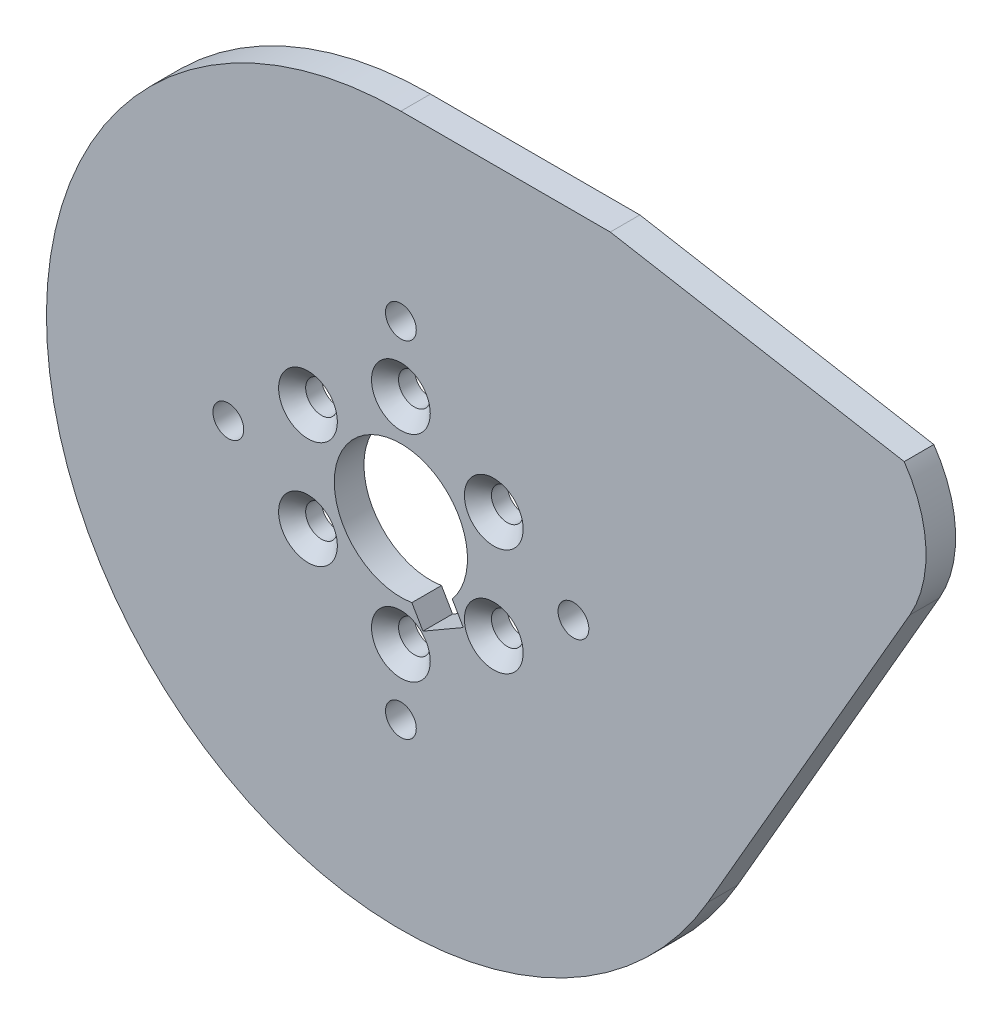
ISO-10303-21;
HEADER;
FILE_DESCRIPTION(('STEP AP214'),'2;1');
FILE_NAME('part.step','',(''),(''),'','','');
FILE_SCHEMA(('AUTOMOTIVE_DESIGN { 1 0 10303 214 1 1 1 1 }'));
ENDSEC;
DATA;
#1=APPLICATION_CONTEXT('core data for automotive mechanical design processes');
#2=APPLICATION_PROTOCOL_DEFINITION('international standard','automotive_design',2000,#1);
#3=PRODUCT_CONTEXT('',#1,'mechanical');
#4=PRODUCT('Part','Part','',(#3));
#5=PRODUCT_RELATED_PRODUCT_CATEGORY('part','',(#4));
#6=PRODUCT_DEFINITION_FORMATION('','',#4);
#7=PRODUCT_DEFINITION_CONTEXT('part definition',#1,'design');
#8=PRODUCT_DEFINITION('design','',#6,#7);
#9=PRODUCT_DEFINITION_SHAPE('','',#8);
#10=(LENGTH_UNIT() NAMED_UNIT(*) SI_UNIT(.MILLI.,.METRE.));
#11=(NAMED_UNIT(*) PLANE_ANGLE_UNIT() SI_UNIT($,.RADIAN.));
#12=(NAMED_UNIT(*) SI_UNIT($,.STERADIAN.) SOLID_ANGLE_UNIT());
#13=UNCERTAINTY_MEASURE_WITH_UNIT(LENGTH_MEASURE(1.E-05),#10,'distance_accuracy_value','');
#14=(GEOMETRIC_REPRESENTATION_CONTEXT(3) GLOBAL_UNCERTAINTY_ASSIGNED_CONTEXT((#13)) GLOBAL_UNIT_ASSIGNED_CONTEXT((#10,
#11,#12)) REPRESENTATION_CONTEXT('',''));
#15=CARTESIAN_POINT('',(0.,0.,0.));
#16=DIRECTION('',(0.,0.,1.));
#17=DIRECTION('',(1.,0.,0.));
#18=AXIS2_PLACEMENT_3D('',#15,#16,#17);
#19=CARTESIAN_POINT('',(43.3012701892193,24.9999999999999,0.));
#20=DIRECTION('',(0.,0.,1.));
#21=DIRECTION('',(1.,0.,0.));
#22=AXIS2_PLACEMENT_3D('',#19,#20,#21);
#23=CYLINDRICAL_SURFACE('',#22,13.0000000000015);
#24=CARTESIAN_POINT('',(43.3012701892193,24.9999999999999,3.175));
#25=DIRECTION('',(0.,0.,1.));
#26=DIRECTION('',(1.,0.,0.));
#27=AXIS2_PLACEMENT_3D('',#24,#25,#26);
#28=CIRCLE('',#27,13.0000000000015);
#29=CARTESIAN_POINT('',(54.5596004384185,18.4999999999991,3.175));
#30=VERTEX_POINT('',#29);
#31=CARTESIAN_POINT('',(53.9595020154315,32.4432583146595,3.175));
#32=VERTEX_POINT('',#31);
#33=EDGE_CURVE('E125',#30,#32,#28,.T.);
#34=ORIENTED_EDGE('',*,*,#33,.F.);
#35=DIRECTION('',(0.,0.,1.));
#36=VECTOR('',#35,1.);
#37=CARTESIAN_POINT('',(54.5596004384185,18.4999999999991,0.));
#38=LINE('',#37,#36);
#39=CARTESIAN_POINT('',(54.5596004384185,18.4999999999991,0.));
#40=VERTEX_POINT('',#39);
#41=EDGE_CURVE('E57',#40,#30,#38,.T.);
#42=ORIENTED_EDGE('',*,*,#41,.F.);
#43=CARTESIAN_POINT('',(43.3012701892193,24.9999999999999,0.));
#44=DIRECTION('',(0.,0.,1.));
#45=DIRECTION('',(1.,0.,0.));
#46=AXIS2_PLACEMENT_3D('',#43,#44,#45);
#47=CIRCLE('',#46,13.0000000000015);
#48=CARTESIAN_POINT('',(53.9595020154315,32.4432583146595,0.));
#49=VERTEX_POINT('',#48);
#50=EDGE_CURVE('E120',#40,#49,#47,.T.);
#51=ORIENTED_EDGE('',*,*,#50,.T.);
#52=DIRECTION('',(0.,0.,1.));
#53=VECTOR('',#52,1.);
#54=CARTESIAN_POINT('',(53.9595020154315,32.4432583146595,0.));
#55=LINE('',#54,#53);
#56=EDGE_CURVE('E87',#49,#32,#55,.T.);
#57=ORIENTED_EDGE('',*,*,#56,.T.);
#58=EDGE_LOOP('',(#34,#42,#51,#57));
#59=FACE_BOUND('',#58,.T.);
#60=ADVANCED_FACE('F34',(#59),#23,.T.);
#61=CARTESIAN_POINT('',(32.9089653438088,-18.9999999999998,0.));
#62=DIRECTION('',(0.866025403784445,-0.499999999999989,0.));
#63=DIRECTION('',(0.499999999999989,0.866025403784445,0.));
#64=AXIS2_PLACEMENT_3D('',#61,#62,#63);
#65=PLANE('',#64);
#66=DIRECTION('',(0.499999999999989,0.866025403784445,0.));
#67=VECTOR('',#66,1.);
#68=CARTESIAN_POINT('',(32.9089653438088,-18.9999999999998,3.175));
#69=LINE('',#68,#67);
#70=CARTESIAN_POINT('',(32.9089653438088,-18.9999999999998,3.175));
#71=VERTEX_POINT('',#70);
#72=EDGE_CURVE('E135',#71,#30,#69,.T.);
#73=ORIENTED_EDGE('',*,*,#72,.F.);
#74=DIRECTION('',(0.,0.,1.));
#75=VECTOR('',#74,1.);
#76=CARTESIAN_POINT('',(32.9089653438088,-18.9999999999998,0.));
#77=LINE('',#76,#75);
#78=CARTESIAN_POINT('',(32.9089653438088,-18.9999999999998,0.));
#79=VERTEX_POINT('',#78);
#80=EDGE_CURVE('E108',#79,#71,#77,.T.);
#81=ORIENTED_EDGE('',*,*,#80,.F.);
#82=DIRECTION('',(0.499999999999989,0.866025403784445,0.));
#83=VECTOR('',#82,1.);
#84=CARTESIAN_POINT('',(32.9089653438088,-18.9999999999998,0.));
#85=LINE('',#84,#83);
#86=EDGE_CURVE('E115',#79,#40,#85,.T.);
#87=ORIENTED_EDGE('',*,*,#86,.T.);
#88=ORIENTED_EDGE('',*,*,#41,.T.);
#89=EDGE_LOOP('',(#73,#81,#87,#88));
#90=FACE_BOUND('',#89,.T.);
#91=ADVANCED_FACE('F163',(#90),#65,.T.);
#92=CARTESIAN_POINT('',(0.,1.23512311489549E-12,0.));
#93=DIRECTION('',(0.,0.,1.));
#94=DIRECTION('',(1.,0.,0.));
#95=AXIS2_PLACEMENT_3D('',#92,#93,#94);
#96=CYLINDRICAL_SURFACE('',#95,38.0000000000004);
#97=CARTESIAN_POINT('',(0.,1.23512311489549E-12,3.175));
#98=DIRECTION('',(0.,0.,1.));
#99=DIRECTION('',(1.,0.,0.));
#100=AXIS2_PLACEMENT_3D('',#97,#98,#99);
#101=CIRCLE('',#100,38.0000000000004);
#102=CARTESIAN_POINT('',(0.,38.0000000000016,3.175));
#103=VERTEX_POINT('',#102);
#104=EDGE_CURVE('E103',#103,#71,#101,.T.);
#105=ORIENTED_EDGE('',*,*,#104,.F.);
#106=DIRECTION('',(0.,0.,1.));
#107=VECTOR('',#106,1.);
#108=CARTESIAN_POINT('',(0.,38.0000000000016,0.));
#109=LINE('',#108,#107);
#110=CARTESIAN_POINT('',(0.,38.0000000000016,0.));
#111=VERTEX_POINT('',#110);
#112=EDGE_CURVE('E97',#111,#103,#109,.T.);
#113=ORIENTED_EDGE('',*,*,#112,.F.);
#114=CARTESIAN_POINT('',(0.,1.23512311489549E-12,0.));
#115=DIRECTION('',(0.,0.,1.));
#116=DIRECTION('',(1.,0.,0.));
#117=AXIS2_PLACEMENT_3D('',#114,#115,#116);
#118=CIRCLE('',#117,38.0000000000004);
#119=EDGE_CURVE('E100',#111,#79,#118,.T.);
#120=ORIENTED_EDGE('',*,*,#119,.T.);
#121=ORIENTED_EDGE('',*,*,#80,.T.);
#122=EDGE_LOOP('',(#105,#113,#120,#121));
#123=FACE_BOUND('',#122,.T.);
#124=ADVANCED_FACE('F99',(#123),#96,.T.);
#125=CARTESIAN_POINT('',(22.4456539190408,38.0000000000013,0.));
#126=DIRECTION('',(0.,1.,0.));
#127=DIRECTION('',(-1.,0.,0.));
#128=AXIS2_PLACEMENT_3D('',#125,#126,#127);
#129=PLANE('',#128);
#130=DIRECTION('',(-1.,0.,0.));
#131=VECTOR('',#130,1.);
#132=CARTESIAN_POINT('',(22.4456539190408,38.0000000000013,3.175));
#133=LINE('',#132,#131);
#134=CARTESIAN_POINT('',(22.4456539190408,38.0000000000013,3.175));
#135=VERTEX_POINT('',#134);
#136=EDGE_CURVE('E132',#135,#103,#133,.T.);
#137=ORIENTED_EDGE('',*,*,#136,.F.);
#138=DIRECTION('',(0.,0.,1.));
#139=VECTOR('',#138,1.);
#140=CARTESIAN_POINT('',(22.4456539190408,38.0000000000013,0.));
#141=LINE('',#140,#139);
#142=CARTESIAN_POINT('',(22.4456539190408,38.0000000000013,0.));
#143=VERTEX_POINT('',#142);
#144=EDGE_CURVE('E109',#143,#135,#141,.T.);
#145=ORIENTED_EDGE('',*,*,#144,.F.);
#146=DIRECTION('',(-1.,0.,0.));
#147=VECTOR('',#146,1.);
#148=CARTESIAN_POINT('',(22.4456539190408,38.0000000000013,0.));
#149=LINE('',#148,#147);
#150=EDGE_CURVE('E114',#143,#111,#149,.T.);
#151=ORIENTED_EDGE('',*,*,#150,.T.);
#152=ORIENTED_EDGE('',*,*,#112,.T.);
#153=EDGE_LOOP('',(#137,#145,#151,#152));
#154=FACE_BOUND('',#153,.T.);
#155=ADVANCED_FACE('F117',(#154),#129,.T.);
#156=CARTESIAN_POINT('',(53.9595020154315,32.4432583146595,0.));
#157=DIRECTION('',(0.173648177666931,0.984807753012208,0.));
#158=DIRECTION('',(-0.984807753012208,0.173648177666931,0.));
#159=AXIS2_PLACEMENT_3D('',#156,#157,#158);
#160=PLANE('',#159);
#161=DIRECTION('',(-0.984807753012208,0.173648177666931,0.));
#162=VECTOR('',#161,1.);
#163=CARTESIAN_POINT('',(53.9595020154315,32.4432583146595,3.175));
#164=LINE('',#163,#162);
#165=EDGE_CURVE('E128',#32,#135,#164,.T.);
#166=ORIENTED_EDGE('',*,*,#165,.F.);
#167=ORIENTED_EDGE('',*,*,#56,.F.);
#168=DIRECTION('',(-0.984807753012208,0.173648177666931,0.));
#169=VECTOR('',#168,1.);
#170=CARTESIAN_POINT('',(53.9595020154315,32.4432583146595,0.));
#171=LINE('',#170,#169);
#172=EDGE_CURVE('E118',#49,#143,#171,.T.);
#173=ORIENTED_EDGE('',*,*,#172,.T.);
#174=ORIENTED_EDGE('',*,*,#144,.T.);
#175=EDGE_LOOP('',(#166,#167,#173,#174));
#176=FACE_BOUND('',#175,.T.);
#177=ADVANCED_FACE('F165',(#176),#160,.T.);
#178=CARTESIAN_POINT('',(43.3012701892193,24.9999999999999,0.));
#179=DIRECTION('',(0.,0.,1.));
#180=DIRECTION('',(1.,0.,0.));
#181=AXIS2_PLACEMENT_3D('',#178,#179,#180);
#182=PLANE('',#181);
#183=CARTESIAN_POINT('',(-9.95929214352075,5.74999999999949,0.));
#184=DIRECTION('',(0.,0.,1.));
#185=DIRECTION('',(1.,0.,0.));
#186=AXIS2_PLACEMENT_3D('',#183,#184,#185);
#187=CIRCLE('',#186,1.69999999999999);
#188=CARTESIAN_POINT('',(-8.25929214352076,5.74999999999949,0.));
#189=VERTEX_POINT('',#188);
#190=EDGE_CURVE('E299',#189,#189,#187,.T.);
#191=ORIENTED_EDGE('',*,*,#190,.T.);
#192=EDGE_LOOP('',(#191));
#193=FACE_BOUND('',#192,.T.);
#194=CARTESIAN_POINT('',(-9.95929214352015,-5.75000000000052,0.));
#195=DIRECTION('',(0.,0.,1.));
#196=DIRECTION('',(1.,0.,0.));
#197=AXIS2_PLACEMENT_3D('',#194,#195,#196);
#198=CIRCLE('',#197,1.69999999999999);
#199=CARTESIAN_POINT('',(-8.25929214352016,-5.75000000000052,0.));
#200=VERTEX_POINT('',#199);
#201=EDGE_CURVE('E308',#200,#200,#198,.T.);
#202=ORIENTED_EDGE('',*,*,#201,.T.);
#203=EDGE_LOOP('',(#202));
#204=FACE_BOUND('',#203,.T.);
#205=CARTESIAN_POINT('',(1.19132134712707E-12,-11.5,0.));
#206=DIRECTION('',(0.,0.,1.));
#207=DIRECTION('',(1.,0.,0.));
#208=AXIS2_PLACEMENT_3D('',#205,#206,#207);
#209=CIRCLE('',#208,1.69999999999999);
#210=CARTESIAN_POINT('',(1.70000000000118,-11.5,0.));
#211=VERTEX_POINT('',#210);
#212=EDGE_CURVE('E317',#211,#211,#209,.T.);
#213=ORIENTED_EDGE('',*,*,#212,.T.);
#214=EDGE_LOOP('',(#213));
#215=FACE_BOUND('',#214,.T.);
#216=CARTESIAN_POINT('',(9.95929214352194,-5.74999999999948,0.));
#217=DIRECTION('',(0.,0.,1.));
#218=DIRECTION('',(1.,0.,0.));
#219=AXIS2_PLACEMENT_3D('',#216,#217,#218);
#220=CIRCLE('',#219,1.69999999999999);
#221=CARTESIAN_POINT('',(11.6592921435219,-5.74999999999948,0.));
#222=VERTEX_POINT('',#221);
#223=EDGE_CURVE('E326',#222,#222,#220,.T.);
#224=ORIENTED_EDGE('',*,*,#223,.T.);
#225=EDGE_LOOP('',(#224));
#226=FACE_BOUND('',#225,.T.);
#227=CARTESIAN_POINT('',(9.95929214352134,5.75000000000052,0.));
#228=DIRECTION('',(0.,0.,1.));
#229=DIRECTION('',(1.,0.,0.));
#230=AXIS2_PLACEMENT_3D('',#227,#228,#229);
#231=CIRCLE('',#230,1.69999999999999);
#232=CARTESIAN_POINT('',(11.6592921435213,5.75000000000052,0.));
#233=VERTEX_POINT('',#232);
#234=EDGE_CURVE('E335',#233,#233,#231,.T.);
#235=ORIENTED_EDGE('',*,*,#234,.T.);
#236=EDGE_LOOP('',(#235));
#237=FACE_BOUND('',#236,.T.);
#238=CARTESIAN_POINT('',(0.,11.5,0.));
#239=DIRECTION('',(0.,0.,1.));
#240=DIRECTION('',(1.,0.,0.));
#241=AXIS2_PLACEMENT_3D('',#238,#239,#240);
#242=CIRCLE('',#241,1.69999999999999);
#243=CARTESIAN_POINT('',(1.69999999999999,11.5,0.));
#244=VERTEX_POINT('',#243);
#245=EDGE_CURVE('E344',#244,#244,#242,.T.);
#246=ORIENTED_EDGE('',*,*,#245,.T.);
#247=EDGE_LOOP('',(#246));
#248=FACE_BOUND('',#247,.T.);
#249=CARTESIAN_POINT('',(18.5000000000006,5.80012052705115E-13,0.));
#250=DIRECTION('',(0.,0.,1.));
#251=DIRECTION('',(1.,0.,0.));
#252=AXIS2_PLACEMENT_3D('',#249,#250,#251);
#253=CIRCLE('',#252,1.64999999999998);
#254=CARTESIAN_POINT('',(20.1500000000006,5.80012052705115E-13,0.));
#255=VERTEX_POINT('',#254);
#256=EDGE_CURVE('E350',#255,#255,#253,.T.);
#257=ORIENTED_EDGE('',*,*,#256,.T.);
#258=EDGE_LOOP('',(#257));
#259=FACE_BOUND('',#258,.T.);
#260=CARTESIAN_POINT('',(1.16002410541023E-12,-18.5,0.));
#261=DIRECTION('',(0.,0.,1.));
#262=DIRECTION('',(1.,0.,0.));
#263=AXIS2_PLACEMENT_3D('',#260,#261,#262);
#264=CIRCLE('',#263,1.64999999999999);
#265=CARTESIAN_POINT('',(1.65000000000115,-18.5,0.));
#266=VERTEX_POINT('',#265);
#267=EDGE_CURVE('E356',#266,#266,#264,.T.);
#268=ORIENTED_EDGE('',*,*,#267,.T.);
#269=EDGE_LOOP('',(#268));
#270=FACE_BOUND('',#269,.T.);
#271=CARTESIAN_POINT('',(-18.4999999999994,-5.82277649283538E-13,0.));
#272=DIRECTION('',(0.,0.,1.));
#273=DIRECTION('',(1.,0.,0.));
#274=AXIS2_PLACEMENT_3D('',#271,#272,#273);
#275=CIRCLE('',#274,1.64999999999998);
#276=CARTESIAN_POINT('',(-16.8499999999994,-5.82277649283538E-13,0.));
#277=VERTEX_POINT('',#276);
#278=EDGE_CURVE('E362',#277,#277,#275,.T.);
#279=ORIENTED_EDGE('',*,*,#278,.T.);
#280=EDGE_LOOP('',(#279));
#281=FACE_BOUND('',#280,.T.);
#282=CARTESIAN_POINT('',(0.,18.5,0.));
#283=DIRECTION('',(0.,0.,1.));
#284=DIRECTION('',(1.,0.,0.));
#285=AXIS2_PLACEMENT_3D('',#282,#283,#284);
#286=CIRCLE('',#285,1.64999999999999);
#287=CARTESIAN_POINT('',(1.64999999999999,18.5,0.));
#288=VERTEX_POINT('',#287);
#289=EDGE_CURVE('E160',#288,#288,#286,.T.);
#290=ORIENTED_EDGE('',*,*,#289,.T.);
#291=EDGE_LOOP('',(#290));
#292=FACE_BOUND('',#291,.T.);
#293=CARTESIAN_POINT('',(0.,0.,0.));
#294=DIRECTION('',(0.,0.,-1.));
#295=DIRECTION('',(-1.,0.,0.));
#296=AXIS2_PLACEMENT_3D('',#293,#294,#295);
#297=CIRCLE('',#296,7.1374);
#298=CARTESIAN_POINT('',(1.177558169701,-7.03959057878869,0.));
#299=VERTEX_POINT('',#298);
#300=CARTESIAN_POINT('',(5.50768518862296,-4.53959057878828,0.));
#301=VERTEX_POINT('',#300);
#302=EDGE_CURVE('E148',#299,#301,#297,.T.);
#303=ORIENTED_EDGE('',*,*,#302,.F.);
#304=DIRECTION('',(-0.500000000000065,0.866025403784401,0.));
#305=VECTOR('',#304,1.);
#306=CARTESIAN_POINT('',(1.10967724974493,-6.92201737656027,0.));
#307=LINE('',#306,#305);
#308=CARTESIAN_POINT('',(2.36418643826195,-9.09489102963338,0.));
#309=VERTEX_POINT('',#308);
#310=EDGE_CURVE('E282',#309,#299,#307,.T.);
#311=ORIENTED_EDGE('',*,*,#310,.F.);
#312=DIRECTION('',(-0.866025403784401,-0.500000000000065,0.));
#313=VECTOR('',#312,1.);
#314=CARTESIAN_POINT('',(2.36418643826195,-9.09489102963338,0.));
#315=LINE('',#314,#313);
#316=CARTESIAN_POINT('',(6.69431345718396,-6.59489102963305,0.));
#317=VERTEX_POINT('',#316);
#318=EDGE_CURVE('E269',#317,#309,#315,.T.);
#319=ORIENTED_EDGE('',*,*,#318,.F.);
#320=DIRECTION('',(0.500000000000065,-0.866025403784401,0.));
#321=VECTOR('',#320,1.);
#322=CARTESIAN_POINT('',(6.69431345718396,-6.59489102963305,0.));
#323=LINE('',#322,#321);
#324=EDGE_CURVE('E279',#301,#317,#323,.T.);
#325=ORIENTED_EDGE('',*,*,#324,.F.);
#326=EDGE_LOOP('',(#303,#311,#319,#325));
#327=FACE_BOUND('',#326,.T.);
#328=ORIENTED_EDGE('',*,*,#50,.F.);
#329=ORIENTED_EDGE('',*,*,#86,.F.);
#330=ORIENTED_EDGE('',*,*,#119,.F.);
#331=ORIENTED_EDGE('',*,*,#150,.F.);
#332=ORIENTED_EDGE('',*,*,#172,.F.);
#333=EDGE_LOOP('',(#328,#329,#330,#331,#332));
#334=FACE_BOUND('',#333,.T.);
#335=ADVANCED_FACE('F113',(#193,#204,#215,#226,#237,#248,#259,#270,#281,#292,#327,#334),#182,.F.);
#336=CARTESIAN_POINT('',(43.3012701892193,24.9999999999999,3.175));
#337=DIRECTION('',(0.,0.,1.));
#338=DIRECTION('',(1.,0.,0.));
#339=AXIS2_PLACEMENT_3D('',#336,#337,#338);
#340=PLANE('',#339);
#341=DIRECTION('',(-0.500000000000065,0.866025403784401,0.));
#342=VECTOR('',#341,1.);
#343=CARTESIAN_POINT('',(1.10967724974493,-6.92201737656027,3.175));
#344=LINE('',#343,#342);
#345=CARTESIAN_POINT('',(2.36418643826195,-9.09489102963338,3.175));
#346=VERTEX_POINT('',#345);
#347=CARTESIAN_POINT('',(1.177558169701,-7.03959057878869,3.175));
#348=VERTEX_POINT('',#347);
#349=EDGE_CURVE('E158',#346,#348,#344,.T.);
#350=ORIENTED_EDGE('',*,*,#349,.T.);
#351=CARTESIAN_POINT('',(0.,0.,3.175));
#352=DIRECTION('',(0.,0.,-1.));
#353=DIRECTION('',(-1.,0.,0.));
#354=AXIS2_PLACEMENT_3D('',#351,#352,#353);
#355=CIRCLE('',#354,7.1374);
#356=CARTESIAN_POINT('',(5.50768518862296,-4.53959057878828,3.175));
#357=VERTEX_POINT('',#356);
#358=EDGE_CURVE('E129',#348,#357,#355,.T.);
#359=ORIENTED_EDGE('',*,*,#358,.T.);
#360=DIRECTION('',(0.500000000000065,-0.866025403784401,0.));
#361=VECTOR('',#360,1.);
#362=CARTESIAN_POINT('',(6.69431345718396,-6.59489102963305,3.175));
#363=LINE('',#362,#361);
#364=CARTESIAN_POINT('',(6.69431345718396,-6.59489102963305,3.175));
#365=VERTEX_POINT('',#364);
#366=EDGE_CURVE('E48',#357,#365,#363,.T.);
#367=ORIENTED_EDGE('',*,*,#366,.T.);
#368=DIRECTION('',(-0.866025403784401,-0.500000000000065,0.));
#369=VECTOR('',#368,1.);
#370=CARTESIAN_POINT('',(2.36418643826195,-9.09489102963338,3.175));
#371=LINE('',#370,#369);
#372=EDGE_CURVE('E288',#365,#346,#371,.T.);
#373=ORIENTED_EDGE('',*,*,#372,.T.);
#374=EDGE_LOOP('',(#350,#359,#367,#373));
#375=FACE_BOUND('',#374,.T.);
#376=CARTESIAN_POINT('',(-9.95929214352075,5.74999999999949,3.175));
#377=DIRECTION('',(0.,0.,1.));
#378=DIRECTION('',(1.,0.,0.));
#379=AXIS2_PLACEMENT_3D('',#376,#377,#378);
#380=CIRCLE('',#379,3.1499999999771);
#381=CARTESIAN_POINT('',(-6.80929214354364,5.74999999999949,3.175));
#382=VERTEX_POINT('',#381);
#383=EDGE_CURVE('E292',#382,#382,#380,.T.);
#384=ORIENTED_EDGE('',*,*,#383,.F.);
#385=EDGE_LOOP('',(#384));
#386=FACE_BOUND('',#385,.T.);
#387=CARTESIAN_POINT('',(-9.95929214352015,-5.75000000000052,3.175));
#388=DIRECTION('',(0.,0.,1.));
#389=DIRECTION('',(1.,0.,0.));
#390=AXIS2_PLACEMENT_3D('',#387,#388,#389);
#391=CIRCLE('',#390,3.1499999999771);
#392=CARTESIAN_POINT('',(-6.80929214354305,-5.75000000000052,3.175));
#393=VERTEX_POINT('',#392);
#394=EDGE_CURVE('E302',#393,#393,#391,.T.);
#395=ORIENTED_EDGE('',*,*,#394,.F.);
#396=EDGE_LOOP('',(#395));
#397=FACE_BOUND('',#396,.T.);
#398=CARTESIAN_POINT('',(1.19132134712707E-12,-11.5,3.175));
#399=DIRECTION('',(0.,0.,1.));
#400=DIRECTION('',(1.,0.,0.));
#401=AXIS2_PLACEMENT_3D('',#398,#399,#400);
#402=CIRCLE('',#401,3.1499999999771);
#403=CARTESIAN_POINT('',(3.14999999997829,-11.5,3.175));
#404=VERTEX_POINT('',#403);
#405=EDGE_CURVE('E311',#404,#404,#402,.T.);
#406=ORIENTED_EDGE('',*,*,#405,.F.);
#407=EDGE_LOOP('',(#406));
#408=FACE_BOUND('',#407,.T.);
#409=CARTESIAN_POINT('',(9.95929214352194,-5.74999999999948,3.175));
#410=DIRECTION('',(0.,0.,1.));
#411=DIRECTION('',(1.,0.,0.));
#412=AXIS2_PLACEMENT_3D('',#409,#410,#411);
#413=CIRCLE('',#412,3.1499999999771);
#414=CARTESIAN_POINT('',(13.109292143499,-5.74999999999948,3.175));
#415=VERTEX_POINT('',#414);
#416=EDGE_CURVE('E320',#415,#415,#413,.T.);
#417=ORIENTED_EDGE('',*,*,#416,.F.);
#418=EDGE_LOOP('',(#417));
#419=FACE_BOUND('',#418,.T.);
#420=CARTESIAN_POINT('',(9.95929214352134,5.75000000000052,3.175));
#421=DIRECTION('',(0.,0.,1.));
#422=DIRECTION('',(1.,0.,0.));
#423=AXIS2_PLACEMENT_3D('',#420,#421,#422);
#424=CIRCLE('',#423,3.1499999999771);
#425=CARTESIAN_POINT('',(13.1092921434984,5.75000000000052,3.175));
#426=VERTEX_POINT('',#425);
#427=EDGE_CURVE('E329',#426,#426,#424,.T.);
#428=ORIENTED_EDGE('',*,*,#427,.F.);
#429=EDGE_LOOP('',(#428));
#430=FACE_BOUND('',#429,.T.);
#431=CARTESIAN_POINT('',(0.,11.5,3.175));
#432=DIRECTION('',(0.,0.,1.));
#433=DIRECTION('',(1.,0.,0.));
#434=AXIS2_PLACEMENT_3D('',#431,#432,#433);
#435=CIRCLE('',#434,3.1499999999771);
#436=CARTESIAN_POINT('',(3.1499999999771,11.5,3.175));
#437=VERTEX_POINT('',#436);
#438=EDGE_CURVE('E338',#437,#437,#435,.T.);
#439=ORIENTED_EDGE('',*,*,#438,.F.);
#440=EDGE_LOOP('',(#439));
#441=FACE_BOUND('',#440,.T.);
#442=CARTESIAN_POINT('',(18.5000000000006,5.80012052705115E-13,3.175));
#443=DIRECTION('',(0.,0.,1.));
#444=DIRECTION('',(1.,0.,0.));
#445=AXIS2_PLACEMENT_3D('',#442,#443,#444);
#446=CIRCLE('',#445,1.64999999999998);
#447=CARTESIAN_POINT('',(20.1500000000006,5.80012052705115E-13,3.175));
#448=VERTEX_POINT('',#447);
#449=EDGE_CURVE('E347',#448,#448,#446,.T.);
#450=ORIENTED_EDGE('',*,*,#449,.F.);
#451=EDGE_LOOP('',(#450));
#452=FACE_BOUND('',#451,.T.);
#453=CARTESIAN_POINT('',(1.16002410541023E-12,-18.5,3.175));
#454=DIRECTION('',(0.,0.,1.));
#455=DIRECTION('',(1.,0.,0.));
#456=AXIS2_PLACEMENT_3D('',#453,#454,#455);
#457=CIRCLE('',#456,1.64999999999999);
#458=CARTESIAN_POINT('',(1.65000000000115,-18.5,3.175));
#459=VERTEX_POINT('',#458);
#460=EDGE_CURVE('E353',#459,#459,#457,.T.);
#461=ORIENTED_EDGE('',*,*,#460,.F.);
#462=EDGE_LOOP('',(#461));
#463=FACE_BOUND('',#462,.T.);
#464=CARTESIAN_POINT('',(-18.4999999999994,-5.82277649283538E-13,3.175));
#465=DIRECTION('',(0.,0.,1.));
#466=DIRECTION('',(1.,0.,0.));
#467=AXIS2_PLACEMENT_3D('',#464,#465,#466);
#468=CIRCLE('',#467,1.64999999999998);
#469=CARTESIAN_POINT('',(-16.8499999999994,-5.82277649283538E-13,3.175));
#470=VERTEX_POINT('',#469);
#471=EDGE_CURVE('E359',#470,#470,#468,.T.);
#472=ORIENTED_EDGE('',*,*,#471,.F.);
#473=EDGE_LOOP('',(#472));
#474=FACE_BOUND('',#473,.T.);
#475=CARTESIAN_POINT('',(0.,18.5,3.175));
#476=DIRECTION('',(0.,0.,1.));
#477=DIRECTION('',(1.,0.,0.));
#478=AXIS2_PLACEMENT_3D('',#475,#476,#477);
#479=CIRCLE('',#478,1.64999999999999);
#480=CARTESIAN_POINT('',(1.64999999999999,18.5,3.175));
#481=VERTEX_POINT('',#480);
#482=EDGE_CURVE('E365',#481,#481,#479,.T.);
#483=ORIENTED_EDGE('',*,*,#482,.F.);
#484=EDGE_LOOP('',(#483));
#485=FACE_BOUND('',#484,.T.);
#486=ORIENTED_EDGE('',*,*,#33,.T.);
#487=ORIENTED_EDGE('',*,*,#165,.T.);
#488=ORIENTED_EDGE('',*,*,#136,.T.);
#489=ORIENTED_EDGE('',*,*,#104,.T.);
#490=ORIENTED_EDGE('',*,*,#72,.T.);
#491=EDGE_LOOP('',(#486,#487,#488,#489,#490));
#492=FACE_BOUND('',#491,.T.);
#493=ADVANCED_FACE('F153',(#375,#386,#397,#408,#419,#430,#441,#452,#463,#474,#485,#492),#340,.T.);
#494=CARTESIAN_POINT('',(0.,0.,3.175));
#495=DIRECTION('',(0.,0.,-1.));
#496=DIRECTION('',(-1.,0.,0.));
#497=AXIS2_PLACEMENT_3D('',#494,#495,#496);
#498=CYLINDRICAL_SURFACE('',#497,7.1374);
#499=ORIENTED_EDGE('',*,*,#358,.F.);
#500=DIRECTION('',(0.,0.,-1.));
#501=VECTOR('',#500,1.);
#502=CARTESIAN_POINT('',(1.177558169701,-7.03959057878869,3.175));
#503=LINE('',#502,#501);
#504=EDGE_CURVE('E11',#348,#299,#503,.T.);
#505=ORIENTED_EDGE('',*,*,#504,.T.);
#506=ORIENTED_EDGE('',*,*,#302,.T.);
#507=DIRECTION('',(0.,0.,-1.));
#508=VECTOR('',#507,1.);
#509=CARTESIAN_POINT('',(5.50768518862296,-4.53959057878828,3.175));
#510=LINE('',#509,#508);
#511=EDGE_CURVE('E41',#301,#357,#510,.F.);
#512=ORIENTED_EDGE('',*,*,#511,.T.);
#513=EDGE_LOOP('',(#499,#505,#506,#512));
#514=FACE_BOUND('',#513,.T.);
#515=ADVANCED_FACE('F145',(#514),#498,.F.);
#516=CARTESIAN_POINT('',(0.,18.5,3.175));
#517=DIRECTION('',(0.,0.,1.));
#518=DIRECTION('',(1.,0.,0.));
#519=AXIS2_PLACEMENT_3D('',#516,#517,#518);
#520=CYLINDRICAL_SURFACE('',#519,1.64999999999999);
#521=ORIENTED_EDGE('',*,*,#289,.F.);
#522=EDGE_LOOP('',(#521));
#523=FACE_BOUND('',#522,.T.);
#524=ORIENTED_EDGE('',*,*,#482,.T.);
#525=EDGE_LOOP('',(#524));
#526=FACE_BOUND('',#525,.T.);
#527=ADVANCED_FACE('F188',(#523,#526),#520,.F.);
#528=CARTESIAN_POINT('',(-18.4999999999994,-5.82277649283538E-13,3.175));
#529=DIRECTION('',(0.,0.,1.));
#530=DIRECTION('',(1.,0.,0.));
#531=AXIS2_PLACEMENT_3D('',#528,#529,#530);
#532=CYLINDRICAL_SURFACE('',#531,1.64999999999998);
#533=ORIENTED_EDGE('',*,*,#278,.F.);
#534=EDGE_LOOP('',(#533));
#535=FACE_BOUND('',#534,.T.);
#536=ORIENTED_EDGE('',*,*,#471,.T.);
#537=EDGE_LOOP('',(#536));
#538=FACE_BOUND('',#537,.T.);
#539=ADVANCED_FACE('F191',(#535,#538),#532,.F.);
#540=CARTESIAN_POINT('',(1.16002410541023E-12,-18.5,3.175));
#541=DIRECTION('',(0.,0.,1.));
#542=DIRECTION('',(1.,0.,0.));
#543=AXIS2_PLACEMENT_3D('',#540,#541,#542);
#544=CYLINDRICAL_SURFACE('',#543,1.64999999999999);
#545=ORIENTED_EDGE('',*,*,#267,.F.);
#546=EDGE_LOOP('',(#545));
#547=FACE_BOUND('',#546,.T.);
#548=ORIENTED_EDGE('',*,*,#460,.T.);
#549=EDGE_LOOP('',(#548));
#550=FACE_BOUND('',#549,.T.);
#551=ADVANCED_FACE('F195',(#547,#550),#544,.F.);
#552=CARTESIAN_POINT('',(18.5000000000006,5.80012052705115E-13,3.175));
#553=DIRECTION('',(0.,0.,1.));
#554=DIRECTION('',(1.,0.,0.));
#555=AXIS2_PLACEMENT_3D('',#552,#553,#554);
#556=CYLINDRICAL_SURFACE('',#555,1.64999999999998);
#557=ORIENTED_EDGE('',*,*,#256,.F.);
#558=EDGE_LOOP('',(#557));
#559=FACE_BOUND('',#558,.T.);
#560=ORIENTED_EDGE('',*,*,#449,.T.);
#561=EDGE_LOOP('',(#560));
#562=FACE_BOUND('',#561,.T.);
#563=ADVANCED_FACE('F199',(#559,#562),#556,.F.);
#564=CARTESIAN_POINT('',(0.,11.5,3.175));
#565=DIRECTION('',(0.,0.,1.));
#566=DIRECTION('',(1.,0.,0.));
#567=AXIS2_PLACEMENT_3D('',#564,#565,#566);
#568=CYLINDRICAL_SURFACE('',#567,1.69999999999999);
#569=ORIENTED_EDGE('',*,*,#245,.F.);
#570=EDGE_LOOP('',(#569));
#571=FACE_BOUND('',#570,.T.);
#572=CARTESIAN_POINT('',(0.,11.5,1.72500000002288));
#573=DIRECTION('',(0.,0.,1.));
#574=DIRECTION('',(1.,0.,0.));
#575=AXIS2_PLACEMENT_3D('',#572,#573,#574);
#576=CIRCLE('',#575,1.69999999999999);
#577=CARTESIAN_POINT('',(1.69999999999999,11.5,1.72500000002288));
#578=VERTEX_POINT('',#577);
#579=EDGE_CURVE('E341',#578,#578,#576,.T.);
#580=ORIENTED_EDGE('',*,*,#579,.T.);
#581=EDGE_LOOP('',(#580));
#582=FACE_BOUND('',#581,.T.);
#583=ADVANCED_FACE('F203',(#571,#582),#568,.F.);
#584=CARTESIAN_POINT('',(0.,11.5,3.175));
#585=DIRECTION('',(0.,0.,1.));
#586=DIRECTION('',(1.,0.,0.));
#587=AXIS2_PLACEMENT_3D('',#584,#585,#586);
#588=CONICAL_SURFACE('',#587,3.1499999999771,0.785398163397446);
#589=ORIENTED_EDGE('',*,*,#579,.F.);
#590=EDGE_LOOP('',(#589));
#591=FACE_BOUND('',#590,.T.);
#592=ORIENTED_EDGE('',*,*,#438,.T.);
#593=EDGE_LOOP('',(#592));
#594=FACE_BOUND('',#593,.T.);
#595=ADVANCED_FACE('F207',(#591,#594),#588,.F.);
#596=CARTESIAN_POINT('',(9.95929214352134,5.75000000000052,3.175));
#597=DIRECTION('',(0.,0.,1.));
#598=DIRECTION('',(1.,0.,0.));
#599=AXIS2_PLACEMENT_3D('',#596,#597,#598);
#600=CYLINDRICAL_SURFACE('',#599,1.69999999999999);
#601=ORIENTED_EDGE('',*,*,#234,.F.);
#602=EDGE_LOOP('',(#601));
#603=FACE_BOUND('',#602,.T.);
#604=CARTESIAN_POINT('',(9.95929214352134,5.75000000000052,1.72500000002288));
#605=DIRECTION('',(0.,0.,1.));
#606=DIRECTION('',(1.,0.,0.));
#607=AXIS2_PLACEMENT_3D('',#604,#605,#606);
#608=CIRCLE('',#607,1.69999999999999);
#609=CARTESIAN_POINT('',(11.6592921435213,5.75000000000052,1.72500000002288));
#610=VERTEX_POINT('',#609);
#611=EDGE_CURVE('E332',#610,#610,#608,.T.);
#612=ORIENTED_EDGE('',*,*,#611,.T.);
#613=EDGE_LOOP('',(#612));
#614=FACE_BOUND('',#613,.T.);
#615=ADVANCED_FACE('F211',(#603,#614),#600,.F.);
#616=CARTESIAN_POINT('',(9.95929214352134,5.75000000000052,3.175));
#617=DIRECTION('',(0.,0.,1.));
#618=DIRECTION('',(1.,0.,0.));
#619=AXIS2_PLACEMENT_3D('',#616,#617,#618);
#620=CONICAL_SURFACE('',#619,3.1499999999771,0.785398163397446);
#621=ORIENTED_EDGE('',*,*,#611,.F.);
#622=EDGE_LOOP('',(#621));
#623=FACE_BOUND('',#622,.T.);
#624=ORIENTED_EDGE('',*,*,#427,.T.);
#625=EDGE_LOOP('',(#624));
#626=FACE_BOUND('',#625,.T.);
#627=ADVANCED_FACE('F215',(#623,#626),#620,.F.);
#628=CARTESIAN_POINT('',(9.95929214352194,-5.74999999999948,3.175));
#629=DIRECTION('',(0.,0.,1.));
#630=DIRECTION('',(1.,0.,0.));
#631=AXIS2_PLACEMENT_3D('',#628,#629,#630);
#632=CYLINDRICAL_SURFACE('',#631,1.69999999999999);
#633=ORIENTED_EDGE('',*,*,#223,.F.);
#634=EDGE_LOOP('',(#633));
#635=FACE_BOUND('',#634,.T.);
#636=CARTESIAN_POINT('',(9.95929214352194,-5.74999999999948,1.72500000002288));
#637=DIRECTION('',(0.,0.,1.));
#638=DIRECTION('',(1.,0.,0.));
#639=AXIS2_PLACEMENT_3D('',#636,#637,#638);
#640=CIRCLE('',#639,1.69999999999999);
#641=CARTESIAN_POINT('',(11.6592921435219,-5.74999999999948,1.72500000002288));
#642=VERTEX_POINT('',#641);
#643=EDGE_CURVE('E323',#642,#642,#640,.T.);
#644=ORIENTED_EDGE('',*,*,#643,.T.);
#645=EDGE_LOOP('',(#644));
#646=FACE_BOUND('',#645,.T.);
#647=ADVANCED_FACE('F219',(#635,#646),#632,.F.);
#648=CARTESIAN_POINT('',(9.95929214352194,-5.74999999999948,3.175));
#649=DIRECTION('',(0.,0.,1.));
#650=DIRECTION('',(1.,0.,0.));
#651=AXIS2_PLACEMENT_3D('',#648,#649,#650);
#652=CONICAL_SURFACE('',#651,3.1499999999771,0.785398163397446);
#653=ORIENTED_EDGE('',*,*,#643,.F.);
#654=EDGE_LOOP('',(#653));
#655=FACE_BOUND('',#654,.T.);
#656=ORIENTED_EDGE('',*,*,#416,.T.);
#657=EDGE_LOOP('',(#656));
#658=FACE_BOUND('',#657,.T.);
#659=ADVANCED_FACE('F223',(#655,#658),#652,.F.);
#660=CARTESIAN_POINT('',(1.19132134712707E-12,-11.5,3.175));
#661=DIRECTION('',(0.,0.,1.));
#662=DIRECTION('',(1.,0.,0.));
#663=AXIS2_PLACEMENT_3D('',#660,#661,#662);
#664=CYLINDRICAL_SURFACE('',#663,1.69999999999999);
#665=ORIENTED_EDGE('',*,*,#212,.F.);
#666=EDGE_LOOP('',(#665));
#667=FACE_BOUND('',#666,.T.);
#668=CARTESIAN_POINT('',(1.19132134712707E-12,-11.5,1.72500000002288));
#669=DIRECTION('',(0.,0.,1.));
#670=DIRECTION('',(1.,0.,0.));
#671=AXIS2_PLACEMENT_3D('',#668,#669,#670);
#672=CIRCLE('',#671,1.69999999999999);
#673=CARTESIAN_POINT('',(1.70000000000118,-11.5,1.72500000002288));
#674=VERTEX_POINT('',#673);
#675=EDGE_CURVE('E314',#674,#674,#672,.T.);
#676=ORIENTED_EDGE('',*,*,#675,.T.);
#677=EDGE_LOOP('',(#676));
#678=FACE_BOUND('',#677,.T.);
#679=ADVANCED_FACE('F227',(#667,#678),#664,.F.);
#680=CARTESIAN_POINT('',(1.19132134712707E-12,-11.5,3.175));
#681=DIRECTION('',(0.,0.,1.));
#682=DIRECTION('',(1.,0.,0.));
#683=AXIS2_PLACEMENT_3D('',#680,#681,#682);
#684=CONICAL_SURFACE('',#683,3.1499999999771,0.785398163397446);
#685=ORIENTED_EDGE('',*,*,#675,.F.);
#686=EDGE_LOOP('',(#685));
#687=FACE_BOUND('',#686,.T.);
#688=ORIENTED_EDGE('',*,*,#405,.T.);
#689=EDGE_LOOP('',(#688));
#690=FACE_BOUND('',#689,.T.);
#691=ADVANCED_FACE('F231',(#687,#690),#684,.F.);
#692=CARTESIAN_POINT('',(-9.95929214352015,-5.75000000000052,3.175));
#693=DIRECTION('',(0.,0.,1.));
#694=DIRECTION('',(1.,0.,0.));
#695=AXIS2_PLACEMENT_3D('',#692,#693,#694);
#696=CYLINDRICAL_SURFACE('',#695,1.69999999999999);
#697=ORIENTED_EDGE('',*,*,#201,.F.);
#698=EDGE_LOOP('',(#697));
#699=FACE_BOUND('',#698,.T.);
#700=CARTESIAN_POINT('',(-9.95929214352015,-5.75000000000052,1.72500000002288));
#701=DIRECTION('',(0.,0.,1.));
#702=DIRECTION('',(1.,0.,0.));
#703=AXIS2_PLACEMENT_3D('',#700,#701,#702);
#704=CIRCLE('',#703,1.69999999999999);
#705=CARTESIAN_POINT('',(-8.25929214352016,-5.75000000000052,1.72500000002288));
#706=VERTEX_POINT('',#705);
#707=EDGE_CURVE('E305',#706,#706,#704,.T.);
#708=ORIENTED_EDGE('',*,*,#707,.T.);
#709=EDGE_LOOP('',(#708));
#710=FACE_BOUND('',#709,.T.);
#711=ADVANCED_FACE('F235',(#699,#710),#696,.F.);
#712=CARTESIAN_POINT('',(-9.95929214352015,-5.75000000000052,3.175));
#713=DIRECTION('',(0.,0.,1.));
#714=DIRECTION('',(1.,0.,0.));
#715=AXIS2_PLACEMENT_3D('',#712,#713,#714);
#716=CONICAL_SURFACE('',#715,3.1499999999771,0.785398163397446);
#717=ORIENTED_EDGE('',*,*,#707,.F.);
#718=EDGE_LOOP('',(#717));
#719=FACE_BOUND('',#718,.T.);
#720=ORIENTED_EDGE('',*,*,#394,.T.);
#721=EDGE_LOOP('',(#720));
#722=FACE_BOUND('',#721,.T.);
#723=ADVANCED_FACE('F239',(#719,#722),#716,.F.);
#724=CARTESIAN_POINT('',(-9.95929214352075,5.74999999999949,3.175));
#725=DIRECTION('',(0.,0.,1.));
#726=DIRECTION('',(1.,0.,0.));
#727=AXIS2_PLACEMENT_3D('',#724,#725,#726);
#728=CYLINDRICAL_SURFACE('',#727,1.69999999999999);
#729=ORIENTED_EDGE('',*,*,#190,.F.);
#730=EDGE_LOOP('',(#729));
#731=FACE_BOUND('',#730,.T.);
#732=CARTESIAN_POINT('',(-9.95929214352075,5.74999999999949,1.72500000002288));
#733=DIRECTION('',(0.,0.,1.));
#734=DIRECTION('',(1.,0.,0.));
#735=AXIS2_PLACEMENT_3D('',#732,#733,#734);
#736=CIRCLE('',#735,1.69999999999999);
#737=CARTESIAN_POINT('',(-8.25929214352076,5.74999999999949,1.72500000002288));
#738=VERTEX_POINT('',#737);
#739=EDGE_CURVE('E296',#738,#738,#736,.T.);
#740=ORIENTED_EDGE('',*,*,#739,.T.);
#741=EDGE_LOOP('',(#740));
#742=FACE_BOUND('',#741,.T.);
#743=ADVANCED_FACE('F243',(#731,#742),#728,.F.);
#744=CARTESIAN_POINT('',(-9.95929214352075,5.74999999999949,3.175));
#745=DIRECTION('',(0.,0.,1.));
#746=DIRECTION('',(1.,0.,0.));
#747=AXIS2_PLACEMENT_3D('',#744,#745,#746);
#748=CONICAL_SURFACE('',#747,3.1499999999771,0.785398163397446);
#749=ORIENTED_EDGE('',*,*,#739,.F.);
#750=EDGE_LOOP('',(#749));
#751=FACE_BOUND('',#750,.T.);
#752=ORIENTED_EDGE('',*,*,#383,.T.);
#753=EDGE_LOOP('',(#752));
#754=FACE_BOUND('',#753,.T.);
#755=ADVANCED_FACE('F247',(#751,#754),#748,.F.);
#756=CARTESIAN_POINT('',(1.10967724974493,-6.92201737656027,3.175));
#757=DIRECTION('',(-0.866025403784401,-0.500000000000065,0.));
#758=DIRECTION('',(0.500000000000065,-0.866025403784401,0.));
#759=AXIS2_PLACEMENT_3D('',#756,#757,#758);
#760=PLANE('',#759);
#761=ORIENTED_EDGE('',*,*,#349,.F.);
#762=DIRECTION('',(0.,0.,-1.));
#763=VECTOR('',#762,1.);
#764=CARTESIAN_POINT('',(2.36418643826195,-9.09489102963338,3.175));
#765=LINE('',#764,#763);
#766=EDGE_CURVE('E274',#346,#309,#765,.T.);
#767=ORIENTED_EDGE('',*,*,#766,.T.);
#768=ORIENTED_EDGE('',*,*,#310,.T.);
#769=ORIENTED_EDGE('',*,*,#504,.F.);
#770=EDGE_LOOP('',(#761,#767,#768,#769));
#771=FACE_BOUND('',#770,.T.);
#772=ADVANCED_FACE('F251',(#771),#760,.F.);
#773=CARTESIAN_POINT('',(6.69431345718396,-6.59489102963305,3.175));
#774=DIRECTION('',(0.866025403784401,0.500000000000065,0.));
#775=DIRECTION('',(-0.500000000000065,0.866025403784401,0.));
#776=AXIS2_PLACEMENT_3D('',#773,#774,#775);
#777=PLANE('',#776);
#778=ORIENTED_EDGE('',*,*,#324,.T.);
#779=DIRECTION('',(0.,0.,-1.));
#780=VECTOR('',#779,1.);
#781=CARTESIAN_POINT('',(6.69431345718396,-6.59489102963305,3.175));
#782=LINE('',#781,#780);
#783=EDGE_CURVE('E276',#365,#317,#782,.T.);
#784=ORIENTED_EDGE('',*,*,#783,.F.);
#785=ORIENTED_EDGE('',*,*,#366,.F.);
#786=ORIENTED_EDGE('',*,*,#511,.F.);
#787=EDGE_LOOP('',(#778,#784,#785,#786));
#788=FACE_BOUND('',#787,.T.);
#789=ADVANCED_FACE('F255',(#788),#777,.F.);
#790=CARTESIAN_POINT('',(2.36418643826195,-9.09489102963338,3.175));
#791=DIRECTION('',(0.500000000000065,-0.866025403784401,0.));
#792=DIRECTION('',(0.866025403784401,0.500000000000065,0.));
#793=AXIS2_PLACEMENT_3D('',#790,#791,#792);
#794=PLANE('',#793);
#795=ORIENTED_EDGE('',*,*,#318,.T.);
#796=ORIENTED_EDGE('',*,*,#766,.F.);
#797=ORIENTED_EDGE('',*,*,#372,.F.);
#798=ORIENTED_EDGE('',*,*,#783,.T.);
#799=EDGE_LOOP('',(#795,#796,#797,#798));
#800=FACE_BOUND('',#799,.T.);
#801=ADVANCED_FACE('F259',(#800),#794,.F.);
#802=CLOSED_SHELL('',(#60,#91,#124,#155,#177,#335,#493,#515,#527,#539,#551,#563,#583,#595,#615,
#627,#647,#659,#679,#691,#711,#723,#743,#755,#772,#789,#801));
#803=MANIFOLD_SOLID_BREP('B2',#802);
#804=ADVANCED_BREP_SHAPE_REPRESENTATION('',(#18,#803),#14);
#805=SHAPE_DEFINITION_REPRESENTATION(#9,#804);
ENDSEC;
END-ISO-10303-21;
